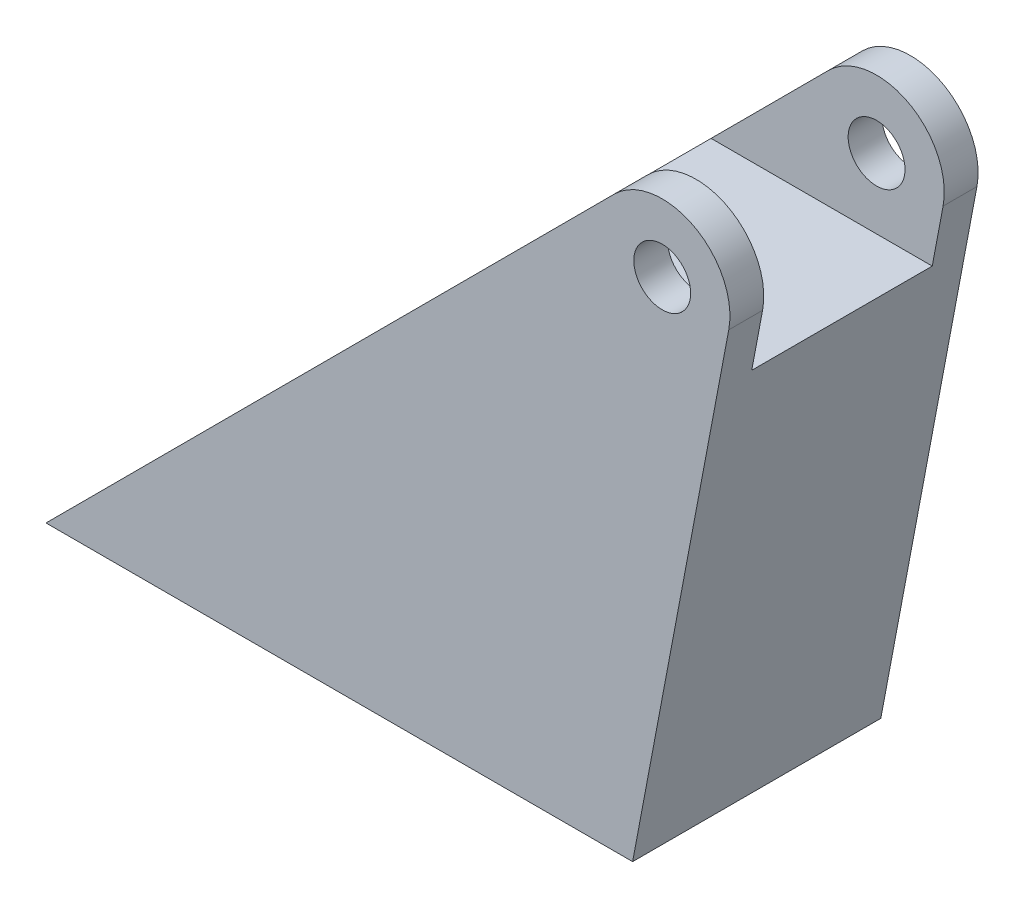
ISO-10303-21;
HEADER;
FILE_DESCRIPTION(('STEP AP214'),'2;1');
FILE_NAME('part.step','',(''),(''),'','','');
FILE_SCHEMA(('AUTOMOTIVE_DESIGN { 1 0 10303 214 1 1 1 1 }'));
ENDSEC;
DATA;
#1=APPLICATION_CONTEXT('core data for automotive mechanical design processes');
#2=APPLICATION_PROTOCOL_DEFINITION('international standard','automotive_design',2000,#1);
#3=PRODUCT_CONTEXT('',#1,'mechanical');
#4=PRODUCT('Part','Part','',(#3));
#5=PRODUCT_RELATED_PRODUCT_CATEGORY('part','',(#4));
#6=PRODUCT_DEFINITION_FORMATION('','',#4);
#7=PRODUCT_DEFINITION_CONTEXT('part definition',#1,'design');
#8=PRODUCT_DEFINITION('design','',#6,#7);
#9=PRODUCT_DEFINITION_SHAPE('','',#8);
#10=(LENGTH_UNIT() NAMED_UNIT(*) SI_UNIT(.MILLI.,.METRE.));
#11=(NAMED_UNIT(*) PLANE_ANGLE_UNIT() SI_UNIT($,.RADIAN.));
#12=(NAMED_UNIT(*) SI_UNIT($,.STERADIAN.) SOLID_ANGLE_UNIT());
#13=UNCERTAINTY_MEASURE_WITH_UNIT(LENGTH_MEASURE(1.E-05),#10,'distance_accuracy_value','');
#14=(GEOMETRIC_REPRESENTATION_CONTEXT(3) GLOBAL_UNCERTAINTY_ASSIGNED_CONTEXT((#13)) GLOBAL_UNIT_ASSIGNED_CONTEXT((#10,
#11,#12)) REPRESENTATION_CONTEXT('',''));
#15=CARTESIAN_POINT('',(0.,0.,0.));
#16=DIRECTION('',(0.,0.,1.));
#17=DIRECTION('',(1.,0.,0.));
#18=AXIS2_PLACEMENT_3D('',#15,#16,#17);
#19=CARTESIAN_POINT('',(4.16611869461281,92.3902344014633,0.));
#20=DIRECTION('',(0.,0.,1.));
#21=DIRECTION('',(1.,0.,0.));
#22=AXIS2_PLACEMENT_3D('',#19,#20,#21);
#23=PLANE('',#22);
#24=CARTESIAN_POINT('',(4.16611869461281,92.3902344014633,0.));
#25=DIRECTION('',(0.,0.,1.));
#26=DIRECTION('',(1.,0.,0.));
#27=AXIS2_PLACEMENT_3D('',#24,#25,#26);
#28=CIRCLE('',#27,4.00000000000001);
#29=CARTESIAN_POINT('',(8.16611869461282,92.3902344014633,0.));
#30=VERTEX_POINT('',#29);
#31=EDGE_CURVE('E96',#30,#30,#28,.T.);
#32=ORIENTED_EDGE('',*,*,#31,.T.);
#33=EDGE_LOOP('',(#32));
#34=FACE_BOUND('',#33,.T.);
#35=DIRECTION('',(1.,0.,0.));
#36=VECTOR('',#35,1.);
#37=CARTESIAN_POINT('',(-82.55,19.05,0.));
#38=LINE('',#37,#36);
#39=CARTESIAN_POINT('',(-82.55,19.05,0.));
#40=VERTEX_POINT('',#39);
#41=CARTESIAN_POINT('',(0.,19.05,0.));
#42=VERTEX_POINT('',#41);
#43=EDGE_CURVE('E108',#40,#42,#38,.T.);
#44=ORIENTED_EDGE('',*,*,#43,.F.);
#45=DIRECTION('',(-0.70668916022688,-0.707524155642637,0.));
#46=VECTOR('',#45,1.);
#47=CARTESIAN_POINT('',(-82.55,19.05,0.));
#48=LINE('',#47,#46);
#49=CARTESIAN_POINT('',(-2.57304888788332,99.1214486526243,0.));
#50=VERTEX_POINT('',#49);
#51=EDGE_CURVE('E84',#50,#40,#48,.T.);
#52=ORIENTED_EDGE('',*,*,#51,.F.);
#53=CARTESIAN_POINT('',(4.16611869461281,92.3902344014633,0.));
#54=DIRECTION('',(0.,0.,1.));
#55=DIRECTION('',(1.,0.,0.));
#56=AXIS2_PLACEMENT_3D('',#53,#54,#55);
#57=CIRCLE('',#56,9.52500000000001);
#58=CARTESIAN_POINT('',(13.5254606994384,90.6215223738264,0.));
#59=VERTEX_POINT('',#58);
#60=EDGE_CURVE('E89',#59,#50,#57,.T.);
#61=ORIENTED_EDGE('',*,*,#60,.F.);
#62=DIRECTION('',(0.185691551457944,0.982608084496124,0.));
#63=VECTOR('',#62,1.);
#64=CARTESIAN_POINT('',(0.,19.05,0.));
#65=LINE('',#64,#63);
#66=EDGE_CURVE('E71',#42,#59,#65,.T.);
#67=ORIENTED_EDGE('',*,*,#66,.F.);
#68=EDGE_LOOP('',(#44,#52,#61,#67));
#69=FACE_BOUND('',#68,.T.);
#70=ADVANCED_FACE('F37',(#34,#69),#23,.F.);
#71=CARTESIAN_POINT('',(4.16611869461281,92.3902344014633,34.925));
#72=DIRECTION('',(0.,0.,1.));
#73=DIRECTION('',(1.,0.,0.));
#74=AXIS2_PLACEMENT_3D('',#71,#72,#73);
#75=PLANE('',#74);
#76=CARTESIAN_POINT('',(4.16611869461281,92.3902344014633,34.925));
#77=DIRECTION('',(0.,0.,1.));
#78=DIRECTION('',(1.,0.,0.));
#79=AXIS2_PLACEMENT_3D('',#76,#77,#78);
#80=CIRCLE('',#79,4.00000000000001);
#81=CARTESIAN_POINT('',(8.16611869461282,92.3902344014633,34.925));
#82=VERTEX_POINT('',#81);
#83=EDGE_CURVE('E156',#82,#82,#80,.T.);
#84=ORIENTED_EDGE('',*,*,#83,.F.);
#85=EDGE_LOOP('',(#84));
#86=FACE_BOUND('',#85,.T.);
#87=DIRECTION('',(0.70668916022688,0.707524155642637,0.));
#88=VECTOR('',#87,1.);
#89=CARTESIAN_POINT('',(-50.8487334230164,50.7887235152745,34.925));
#90=LINE('',#89,#88);
#91=CARTESIAN_POINT('',(-82.55,19.05,34.925));
#92=VERTEX_POINT('',#91);
#93=CARTESIAN_POINT('',(-2.5730488878833,99.1214486526243,34.925));
#94=VERTEX_POINT('',#93);
#95=EDGE_CURVE('E149',#92,#94,#90,.T.);
#96=ORIENTED_EDGE('',*,*,#95,.F.);
#97=DIRECTION('',(-1.,0.,0.));
#98=VECTOR('',#97,1.);
#99=CARTESIAN_POINT('',(0.,19.05,34.925));
#100=LINE('',#99,#98);
#101=CARTESIAN_POINT('',(0.,19.05,34.925));
#102=VERTEX_POINT('',#101);
#103=EDGE_CURVE('E111',#102,#92,#100,.T.);
#104=ORIENTED_EDGE('',*,*,#103,.F.);
#105=DIRECTION('',(-0.185691551457944,-0.982608084496124,0.));
#106=VECTOR('',#105,1.);
#107=CARTESIAN_POINT('',(-3.47590147500313,0.656869760988449,34.925));
#108=LINE('',#107,#106);
#109=CARTESIAN_POINT('',(13.5254606994384,90.6215223738264,34.925));
#110=VERTEX_POINT('',#109);
#111=EDGE_CURVE('E143',#110,#102,#108,.T.);
#112=ORIENTED_EDGE('',*,*,#111,.F.);
#113=CARTESIAN_POINT('',(4.16611869461281,92.3902344014633,34.925));
#114=DIRECTION('',(0.,0.,1.));
#115=DIRECTION('',(1.,0.,0.));
#116=AXIS2_PLACEMENT_3D('',#113,#114,#115);
#117=CIRCLE('',#116,9.52500000000001);
#118=EDGE_CURVE('E158',#110,#94,#117,.T.);
#119=ORIENTED_EDGE('',*,*,#118,.T.);
#120=EDGE_LOOP('',(#96,#104,#112,#119));
#121=FACE_BOUND('',#120,.T.);
#122=ADVANCED_FACE('F226',(#86,#121),#75,.T.);
#123=CARTESIAN_POINT('',(4.16611869461281,92.3902344014633,4.7625));
#124=DIRECTION('',(0.,0.,1.));
#125=DIRECTION('',(1.,0.,0.));
#126=AXIS2_PLACEMENT_3D('',#123,#124,#125);
#127=PLANE('',#126);
#128=DIRECTION('',(-1.,0.,0.));
#129=VECTOR('',#128,1.);
#130=CARTESIAN_POINT('',(-19.1249404928125,82.55,4.7625));
#131=LINE('',#130,#129);
#132=CARTESIAN_POINT('',(12.0001185657108,82.55,4.7625));
#133=VERTEX_POINT('',#132);
#134=CARTESIAN_POINT('',(-19.1249404928125,82.55,4.7625));
#135=VERTEX_POINT('',#134);
#136=EDGE_CURVE('E52',#133,#135,#131,.T.);
#137=ORIENTED_EDGE('',*,*,#136,.F.);
#138=DIRECTION('',(0.185691551457944,0.982608084496124,0.));
#139=VECTOR('',#138,1.);
#140=CARTESIAN_POINT('',(0.,19.05,4.7625));
#141=LINE('',#140,#139);
#142=CARTESIAN_POINT('',(13.5254606994384,90.6215223738264,4.7625));
#143=VERTEX_POINT('',#142);
#144=EDGE_CURVE('E57',#133,#143,#141,.T.);
#145=ORIENTED_EDGE('',*,*,#144,.T.);
#146=CARTESIAN_POINT('',(4.16611869461281,92.3902344014633,4.7625));
#147=DIRECTION('',(0.,0.,1.));
#148=DIRECTION('',(1.,0.,0.));
#149=AXIS2_PLACEMENT_3D('',#146,#147,#148);
#150=CIRCLE('',#149,9.52500000000001);
#151=CARTESIAN_POINT('',(-2.57304888788332,99.1214486526243,4.7625));
#152=VERTEX_POINT('',#151);
#153=EDGE_CURVE('E83',#143,#152,#150,.T.);
#154=ORIENTED_EDGE('',*,*,#153,.T.);
#155=DIRECTION('',(-0.70668916022688,-0.707524155642637,0.));
#156=VECTOR('',#155,1.);
#157=CARTESIAN_POINT('',(-82.55,19.05,4.7625));
#158=LINE('',#157,#156);
#159=EDGE_CURVE('E120',#152,#135,#158,.T.);
#160=ORIENTED_EDGE('',*,*,#159,.T.);
#161=EDGE_LOOP('',(#137,#145,#154,#160));
#162=FACE_BOUND('',#161,.T.);
#163=CARTESIAN_POINT('',(4.16611869461281,92.3902344014633,4.7625));
#164=DIRECTION('',(0.,0.,1.));
#165=DIRECTION('',(1.,0.,0.));
#166=AXIS2_PLACEMENT_3D('',#163,#164,#165);
#167=CIRCLE('',#166,4.00000000000001);
#168=CARTESIAN_POINT('',(8.16611869461282,92.3902344014633,4.7625));
#169=VERTEX_POINT('',#168);
#170=EDGE_CURVE('E92',#169,#169,#167,.T.);
#171=ORIENTED_EDGE('',*,*,#170,.F.);
#172=EDGE_LOOP('',(#171));
#173=FACE_BOUND('',#172,.T.);
#174=ADVANCED_FACE('F125',(#162,#173),#127,.T.);
#175=CARTESIAN_POINT('',(4.16611869461281,92.3902344014633,4.7625));
#176=DIRECTION('',(0.,0.,-1.));
#177=DIRECTION('',(-1.,0.,0.));
#178=AXIS2_PLACEMENT_3D('',#175,#176,#177);
#179=CYLINDRICAL_SURFACE('',#178,9.52500000000001);
#180=ORIENTED_EDGE('',*,*,#60,.T.);
#181=DIRECTION('',(0.,0.,-1.));
#182=VECTOR('',#181,1.);
#183=CARTESIAN_POINT('',(-2.57304888788332,99.1214486526243,4.7625));
#184=LINE('',#183,#182);
#185=EDGE_CURVE('E11',#152,#50,#184,.T.);
#186=ORIENTED_EDGE('',*,*,#185,.F.);
#187=ORIENTED_EDGE('',*,*,#153,.F.);
#188=DIRECTION('',(0.,0.,-1.));
#189=VECTOR('',#188,1.);
#190=CARTESIAN_POINT('',(13.5254606994384,90.6215223738264,4.7625));
#191=LINE('',#190,#189);
#192=EDGE_CURVE('E74',#143,#59,#191,.T.);
#193=ORIENTED_EDGE('',*,*,#192,.T.);
#194=EDGE_LOOP('',(#180,#186,#187,#193));
#195=FACE_BOUND('',#194,.T.);
#196=ADVANCED_FACE('F39',(#195),#179,.T.);
#197=CARTESIAN_POINT('',(-82.55,19.05,4.7625));
#198=DIRECTION('',(0.707524155642637,-0.70668916022688,0.));
#199=DIRECTION('',(0.70668916022688,0.707524155642637,0.));
#200=AXIS2_PLACEMENT_3D('',#197,#198,#199);
#201=PLANE('',#200);
#202=CARTESIAN_POINT('',(-73.025,28.5862543559215,9.525));
#203=DIRECTION('',(0.707524155642637,-0.70668916022688,0.));
#204=DIRECTION('',(-0.70668916022688,-0.707524155642637,0.));
#205=AXIS2_PLACEMENT_3D('',#202,#203,#204);
#206=ELLIPSE('',#205,4.61857940335767,3.26389999999999);
#207=CARTESIAN_POINT('',(-76.2889,25.3184978632924,9.525));
#208=VERTEX_POINT('',#207);
#209=EDGE_CURVE('E116',#208,#208,#206,.T.);
#210=ORIENTED_EDGE('',*,*,#209,.T.);
#211=EDGE_LOOP('',(#210));
#212=FACE_BOUND('',#211,.T.);
#213=CARTESIAN_POINT('',(-73.025,28.5862543559215,28.575));
#214=DIRECTION('',(0.707524155642637,-0.70668916022688,0.));
#215=DIRECTION('',(-0.70668916022688,-0.707524155642637,0.));
#216=AXIS2_PLACEMENT_3D('',#213,#214,#215);
#217=ELLIPSE('',#216,4.61857940335767,3.26389999999999);
#218=CARTESIAN_POINT('',(-76.2889,25.3184978632924,28.575));
#219=VERTEX_POINT('',#218);
#220=EDGE_CURVE('E170',#219,#219,#217,.T.);
#221=ORIENTED_EDGE('',*,*,#220,.T.);
#222=EDGE_LOOP('',(#221));
#223=FACE_BOUND('',#222,.T.);
#224=CARTESIAN_POINT('',(-73.025,28.5862543559215,19.05));
#225=DIRECTION('',(0.707524155642637,-0.70668916022688,0.));
#226=DIRECTION('',(-0.70668916022688,-0.707524155642637,0.));
#227=AXIS2_PLACEMENT_3D('',#224,#225,#226);
#228=ELLIPSE('',#227,4.61857940335767,3.2639);
#229=CARTESIAN_POINT('',(-76.2889,25.3184978632924,19.05));
#230=VERTEX_POINT('',#229);
#231=EDGE_CURVE('E173',#230,#230,#228,.T.);
#232=ORIENTED_EDGE('',*,*,#231,.T.);
#233=EDGE_LOOP('',(#232));
#234=FACE_BOUND('',#233,.T.);
#235=ORIENTED_EDGE('',*,*,#51,.T.);
#236=DIRECTION('',(0.,0.,-1.));
#237=VECTOR('',#236,1.);
#238=CARTESIAN_POINT('',(-82.55,19.05,4.7625));
#239=LINE('',#238,#237);
#240=EDGE_CURVE('E45',#92,#40,#239,.T.);
#241=ORIENTED_EDGE('',*,*,#240,.F.);
#242=ORIENTED_EDGE('',*,*,#95,.T.);
#243=DIRECTION('',(0.,0.,-1.));
#244=VECTOR('',#243,1.);
#245=CARTESIAN_POINT('',(-2.5730488878833,99.1214486526243,34.925));
#246=LINE('',#245,#244);
#247=CARTESIAN_POINT('',(-2.5730488878833,99.1214486526243,30.1625));
#248=VERTEX_POINT('',#247);
#249=EDGE_CURVE('E140',#94,#248,#246,.T.);
#250=ORIENTED_EDGE('',*,*,#249,.T.);
#251=DIRECTION('',(0.70668916022688,0.707524155642637,0.));
#252=VECTOR('',#251,1.);
#253=CARTESIAN_POINT('',(-50.8487334230164,50.7887235152745,30.1625));
#254=LINE('',#253,#252);
#255=CARTESIAN_POINT('',(-19.1249404928125,82.55,30.1625));
#256=VERTEX_POINT('',#255);
#257=EDGE_CURVE('E153',#256,#248,#254,.T.);
#258=ORIENTED_EDGE('',*,*,#257,.F.);
#259=DIRECTION('',(0.,0.,-1.));
#260=VECTOR('',#259,1.);
#261=CARTESIAN_POINT('',(-19.1249404928125,82.55,30.1625));
#262=LINE('',#261,#260);
#263=EDGE_CURVE('E124',#256,#135,#262,.T.);
#264=ORIENTED_EDGE('',*,*,#263,.T.);
#265=ORIENTED_EDGE('',*,*,#159,.F.);
#266=ORIENTED_EDGE('',*,*,#185,.T.);
#267=EDGE_LOOP('',(#235,#241,#242,#250,#258,#264,#265,#266));
#268=FACE_BOUND('',#267,.T.);
#269=ADVANCED_FACE('F118',(#212,#223,#234,#268),#201,.F.);
#270=CARTESIAN_POINT('',(0.,19.05,4.7625));
#271=DIRECTION('',(-0.982608084496124,0.185691551457944,0.));
#272=DIRECTION('',(-0.185691551457944,-0.982608084496124,0.));
#273=AXIS2_PLACEMENT_3D('',#270,#271,#272);
#274=PLANE('',#273);
#275=ORIENTED_EDGE('',*,*,#66,.T.);
#276=ORIENTED_EDGE('',*,*,#192,.F.);
#277=ORIENTED_EDGE('',*,*,#144,.F.);
#278=DIRECTION('',(0.,0.,-1.));
#279=VECTOR('',#278,1.);
#280=CARTESIAN_POINT('',(12.0001185657108,82.55,30.1625));
#281=LINE('',#280,#279);
#282=CARTESIAN_POINT('',(12.0001185657108,82.55,30.1625));
#283=VERTEX_POINT('',#282);
#284=EDGE_CURVE('E130',#283,#133,#281,.T.);
#285=ORIENTED_EDGE('',*,*,#284,.F.);
#286=DIRECTION('',(-0.185691551457944,-0.982608084496124,0.));
#287=VECTOR('',#286,1.);
#288=CARTESIAN_POINT('',(-3.47590147500313,0.656869760988449,30.1625));
#289=LINE('',#288,#287);
#290=CARTESIAN_POINT('',(13.5254606994384,90.6215223738264,30.1625));
#291=VERTEX_POINT('',#290);
#292=EDGE_CURVE('E146',#291,#283,#289,.T.);
#293=ORIENTED_EDGE('',*,*,#292,.F.);
#294=DIRECTION('',(0.,0.,-1.));
#295=VECTOR('',#294,1.);
#296=CARTESIAN_POINT('',(13.5254606994384,90.6215223738264,34.925));
#297=LINE('',#296,#295);
#298=EDGE_CURVE('E137',#110,#291,#297,.T.);
#299=ORIENTED_EDGE('',*,*,#298,.F.);
#300=ORIENTED_EDGE('',*,*,#111,.T.);
#301=DIRECTION('',(0.,0.,-1.));
#302=VECTOR('',#301,1.);
#303=CARTESIAN_POINT('',(0.,19.05,4.7625));
#304=LINE('',#303,#302);
#305=EDGE_CURVE('E79',#102,#42,#304,.T.);
#306=ORIENTED_EDGE('',*,*,#305,.T.);
#307=EDGE_LOOP('',(#275,#276,#277,#285,#293,#299,#300,#306));
#308=FACE_BOUND('',#307,.T.);
#309=ADVANCED_FACE('F73',(#308),#274,.F.);
#310=CARTESIAN_POINT('',(4.16611869461281,92.3902344014633,4.7625));
#311=DIRECTION('',(0.,0.,-1.));
#312=DIRECTION('',(-1.,0.,0.));
#313=AXIS2_PLACEMENT_3D('',#310,#311,#312);
#314=CYLINDRICAL_SURFACE('',#313,4.00000000000001);
#315=ORIENTED_EDGE('',*,*,#170,.T.);
#316=EDGE_LOOP('',(#315));
#317=FACE_BOUND('',#316,.T.);
#318=ORIENTED_EDGE('',*,*,#31,.F.);
#319=EDGE_LOOP('',(#318));
#320=FACE_BOUND('',#319,.T.);
#321=ADVANCED_FACE('F238',(#317,#320),#314,.F.);
#322=CARTESIAN_POINT('',(-19.1249404928125,82.55,30.1625));
#323=DIRECTION('',(0.,-1.,0.));
#324=DIRECTION('',(0.,0.,-1.));
#325=AXIS2_PLACEMENT_3D('',#322,#323,#324);
#326=PLANE('',#325);
#327=ORIENTED_EDGE('',*,*,#136,.T.);
#328=ORIENTED_EDGE('',*,*,#263,.F.);
#329=DIRECTION('',(-1.,0.,0.));
#330=VECTOR('',#329,1.);
#331=CARTESIAN_POINT('',(-19.1249404928125,82.55,30.1625));
#332=LINE('',#331,#330);
#333=EDGE_CURVE('E135',#283,#256,#332,.T.);
#334=ORIENTED_EDGE('',*,*,#333,.F.);
#335=ORIENTED_EDGE('',*,*,#284,.T.);
#336=EDGE_LOOP('',(#327,#328,#334,#335));
#337=FACE_BOUND('',#336,.T.);
#338=ADVANCED_FACE('F369',(#337),#326,.F.);
#339=CARTESIAN_POINT('',(4.16611869461281,92.3902344014633,30.1625));
#340=DIRECTION('',(0.,0.,1.));
#341=DIRECTION('',(1.,0.,0.));
#342=AXIS2_PLACEMENT_3D('',#339,#340,#341);
#343=PLANE('',#342);
#344=CARTESIAN_POINT('',(4.16611869461281,92.3902344014633,30.1625));
#345=DIRECTION('',(0.,0.,1.));
#346=DIRECTION('',(1.,0.,0.));
#347=AXIS2_PLACEMENT_3D('',#344,#345,#346);
#348=CIRCLE('',#347,4.00000000000001);
#349=CARTESIAN_POINT('',(8.16611869461282,92.3902344014633,30.1625));
#350=VERTEX_POINT('',#349);
#351=EDGE_CURVE('E162',#350,#350,#348,.T.);
#352=ORIENTED_EDGE('',*,*,#351,.T.);
#353=EDGE_LOOP('',(#352));
#354=FACE_BOUND('',#353,.T.);
#355=ORIENTED_EDGE('',*,*,#292,.T.);
#356=ORIENTED_EDGE('',*,*,#333,.T.);
#357=ORIENTED_EDGE('',*,*,#257,.T.);
#358=CARTESIAN_POINT('',(4.16611869461281,92.3902344014633,30.1625));
#359=DIRECTION('',(0.,0.,1.));
#360=DIRECTION('',(1.,0.,0.));
#361=AXIS2_PLACEMENT_3D('',#358,#359,#360);
#362=CIRCLE('',#361,9.52500000000001);
#363=EDGE_CURVE('E150',#291,#248,#362,.T.);
#364=ORIENTED_EDGE('',*,*,#363,.F.);
#365=EDGE_LOOP('',(#355,#356,#357,#364));
#366=FACE_BOUND('',#365,.T.);
#367=ADVANCED_FACE('F360',(#354,#366),#343,.F.);
#368=CARTESIAN_POINT('',(4.16611869461281,92.3902344014633,34.925));
#369=DIRECTION('',(0.,0.,-1.));
#370=DIRECTION('',(-1.,0.,0.));
#371=AXIS2_PLACEMENT_3D('',#368,#369,#370);
#372=CYLINDRICAL_SURFACE('',#371,9.52500000000001);
#373=ORIENTED_EDGE('',*,*,#363,.T.);
#374=ORIENTED_EDGE('',*,*,#249,.F.);
#375=ORIENTED_EDGE('',*,*,#118,.F.);
#376=ORIENTED_EDGE('',*,*,#298,.T.);
#377=EDGE_LOOP('',(#373,#374,#375,#376));
#378=FACE_BOUND('',#377,.T.);
#379=ADVANCED_FACE('F351',(#378),#372,.T.);
#380=CARTESIAN_POINT('',(4.16611869461281,92.3902344014633,34.925));
#381=DIRECTION('',(0.,0.,-1.));
#382=DIRECTION('',(-1.,0.,0.));
#383=AXIS2_PLACEMENT_3D('',#380,#381,#382);
#384=CYLINDRICAL_SURFACE('',#383,4.00000000000001);
#385=ORIENTED_EDGE('',*,*,#83,.T.);
#386=EDGE_LOOP('',(#385));
#387=FACE_BOUND('',#386,.T.);
#388=ORIENTED_EDGE('',*,*,#351,.F.);
#389=EDGE_LOOP('',(#388));
#390=FACE_BOUND('',#389,.T.);
#391=ADVANCED_FACE('F210',(#387,#390),#384,.F.);
#392=CARTESIAN_POINT('',(0.,19.05,0.));
#393=DIRECTION('',(0.,-1.,0.));
#394=DIRECTION('',(0.,0.,-1.));
#395=AXIS2_PLACEMENT_3D('',#392,#393,#394);
#396=PLANE('',#395);
#397=CARTESIAN_POINT('',(-73.025,19.05,9.525));
#398=DIRECTION('',(0.,-1.,0.));
#399=DIRECTION('',(0.,0.,-1.));
#400=AXIS2_PLACEMENT_3D('',#397,#398,#399);
#401=CIRCLE('',#400,3.26389999999999);
#402=CARTESIAN_POINT('',(-73.025,19.05,6.2611));
#403=VERTEX_POINT('',#402);
#404=EDGE_CURVE('E180',#403,#403,#401,.T.);
#405=ORIENTED_EDGE('',*,*,#404,.F.);
#406=EDGE_LOOP('',(#405));
#407=FACE_BOUND('',#406,.T.);
#408=CARTESIAN_POINT('',(-73.025,19.05,28.575));
#409=DIRECTION('',(0.,-1.,0.));
#410=DIRECTION('',(0.,0.,1.));
#411=AXIS2_PLACEMENT_3D('',#408,#409,#410);
#412=CIRCLE('',#411,3.26389999999999);
#413=CARTESIAN_POINT('',(-73.025,19.05,31.8389));
#414=VERTEX_POINT('',#413);
#415=EDGE_CURVE('E196',#414,#414,#412,.T.);
#416=ORIENTED_EDGE('',*,*,#415,.F.);
#417=EDGE_LOOP('',(#416));
#418=FACE_BOUND('',#417,.T.);
#419=CARTESIAN_POINT('',(-9.525,19.05,28.575));
#420=DIRECTION('',(0.,-1.,0.));
#421=DIRECTION('',(0.,0.,1.));
#422=AXIS2_PLACEMENT_3D('',#419,#420,#421);
#423=CIRCLE('',#422,3.2639);
#424=CARTESIAN_POINT('',(-9.525,19.05,31.8389));
#425=VERTEX_POINT('',#424);
#426=EDGE_CURVE('E190',#425,#425,#423,.T.);
#427=ORIENTED_EDGE('',*,*,#426,.F.);
#428=EDGE_LOOP('',(#427));
#429=FACE_BOUND('',#428,.T.);
#430=CARTESIAN_POINT('',(-9.525,19.05,19.05));
#431=DIRECTION('',(0.,-1.,0.));
#432=DIRECTION('',(0.,0.,-1.));
#433=AXIS2_PLACEMENT_3D('',#430,#431,#432);
#434=CIRCLE('',#433,3.2639);
#435=CARTESIAN_POINT('',(-9.525,19.05,15.7861));
#436=VERTEX_POINT('',#435);
#437=EDGE_CURVE('E183',#436,#436,#434,.T.);
#438=ORIENTED_EDGE('',*,*,#437,.F.);
#439=EDGE_LOOP('',(#438));
#440=FACE_BOUND('',#439,.T.);
#441=CARTESIAN_POINT('',(-73.025,19.05,19.05));
#442=DIRECTION('',(0.,-1.,0.));
#443=DIRECTION('',(0.,0.,-1.));
#444=AXIS2_PLACEMENT_3D('',#441,#442,#443);
#445=CIRCLE('',#444,3.2639);
#446=CARTESIAN_POINT('',(-73.025,19.05,15.7861));
#447=VERTEX_POINT('',#446);
#448=EDGE_CURVE('E187',#447,#447,#445,.T.);
#449=ORIENTED_EDGE('',*,*,#448,.F.);
#450=EDGE_LOOP('',(#449));
#451=FACE_BOUND('',#450,.T.);
#452=CARTESIAN_POINT('',(-9.525,19.05,9.52500000000001));
#453=DIRECTION('',(0.,-1.,0.));
#454=DIRECTION('',(0.,0.,-1.));
#455=AXIS2_PLACEMENT_3D('',#452,#453,#454);
#456=CIRCLE('',#455,3.2639);
#457=CARTESIAN_POINT('',(-9.525,19.05,6.26110000000001));
#458=VERTEX_POINT('',#457);
#459=EDGE_CURVE('E177',#458,#458,#456,.T.);
#460=ORIENTED_EDGE('',*,*,#459,.F.);
#461=EDGE_LOOP('',(#460));
#462=FACE_BOUND('',#461,.T.);
#463=ORIENTED_EDGE('',*,*,#240,.T.);
#464=ORIENTED_EDGE('',*,*,#43,.T.);
#465=ORIENTED_EDGE('',*,*,#305,.F.);
#466=ORIENTED_EDGE('',*,*,#103,.T.);
#467=EDGE_LOOP('',(#463,#464,#465,#466));
#468=FACE_BOUND('',#467,.T.);
#469=ADVANCED_FACE('F107',(#407,#418,#429,#440,#451,#462,#468),#396,.T.);
#470=CARTESIAN_POINT('',(-9.525,50.8,9.52500000000001));
#471=DIRECTION('',(0.,-1.,0.));
#472=DIRECTION('',(0.,0.,-1.));
#473=AXIS2_PLACEMENT_3D('',#470,#471,#472);
#474=CYLINDRICAL_SURFACE('',#473,3.2639);
#475=CARTESIAN_POINT('',(-9.525,50.8,9.52500000000001));
#476=DIRECTION('',(0.,-1.,0.));
#477=DIRECTION('',(0.,0.,-1.));
#478=AXIS2_PLACEMENT_3D('',#475,#476,#477);
#479=CIRCLE('',#478,3.2639);
#480=CARTESIAN_POINT('',(-9.525,50.8,6.26110000000001));
#481=VERTEX_POINT('',#480);
#482=EDGE_CURVE('E176',#481,#481,#479,.T.);
#483=ORIENTED_EDGE('',*,*,#482,.F.);
#484=EDGE_LOOP('',(#483));
#485=FACE_BOUND('',#484,.T.);
#486=ORIENTED_EDGE('',*,*,#459,.T.);
#487=EDGE_LOOP('',(#486));
#488=FACE_BOUND('',#487,.T.);
#489=ADVANCED_FACE('F209',(#485,#488),#474,.F.);
#490=CARTESIAN_POINT('',(-9.525,50.8,9.52500000000001));
#491=DIRECTION('',(0.,-1.,0.));
#492=DIRECTION('',(0.,0.,-1.));
#493=AXIS2_PLACEMENT_3D('',#490,#491,#492);
#494=PLANE('',#493);
#495=ORIENTED_EDGE('',*,*,#482,.T.);
#496=EDGE_LOOP('',(#495));
#497=FACE_BOUND('',#496,.T.);
#498=ADVANCED_FACE('F216',(#497),#494,.T.);
#499=CARTESIAN_POINT('',(-73.025,50.8,19.05));
#500=DIRECTION('',(0.,-1.,0.));
#501=DIRECTION('',(0.,0.,-1.));
#502=AXIS2_PLACEMENT_3D('',#499,#500,#501);
#503=CYLINDRICAL_SURFACE('',#502,3.2639);
#504=ORIENTED_EDGE('',*,*,#448,.T.);
#505=EDGE_LOOP('',(#504));
#506=FACE_BOUND('',#505,.T.);
#507=ORIENTED_EDGE('',*,*,#231,.F.);
#508=EDGE_LOOP('',(#507));
#509=FACE_BOUND('',#508,.T.);
#510=ADVANCED_FACE('F204',(#506,#509),#503,.F.);
#511=CARTESIAN_POINT('',(-9.525,50.8,19.05));
#512=DIRECTION('',(0.,-1.,0.));
#513=DIRECTION('',(0.,0.,-1.));
#514=AXIS2_PLACEMENT_3D('',#511,#512,#513);
#515=CYLINDRICAL_SURFACE('',#514,3.2639);
#516=CARTESIAN_POINT('',(-9.525,50.8,19.05));
#517=DIRECTION('',(0.,-1.,0.));
#518=DIRECTION('',(0.,0.,-1.));
#519=AXIS2_PLACEMENT_3D('',#516,#517,#518);
#520=CIRCLE('',#519,3.2639);
#521=CARTESIAN_POINT('',(-9.525,50.8,15.7861));
#522=VERTEX_POINT('',#521);
#523=EDGE_CURVE('E186',#522,#522,#520,.T.);
#524=ORIENTED_EDGE('',*,*,#523,.F.);
#525=EDGE_LOOP('',(#524));
#526=FACE_BOUND('',#525,.T.);
#527=ORIENTED_EDGE('',*,*,#437,.T.);
#528=EDGE_LOOP('',(#527));
#529=FACE_BOUND('',#528,.T.);
#530=ADVANCED_FACE('F250',(#526,#529),#515,.F.);
#531=CARTESIAN_POINT('',(-9.525,50.8,19.05));
#532=DIRECTION('',(0.,-1.,0.));
#533=DIRECTION('',(0.,0.,-1.));
#534=AXIS2_PLACEMENT_3D('',#531,#532,#533);
#535=PLANE('',#534);
#536=ORIENTED_EDGE('',*,*,#523,.T.);
#537=EDGE_LOOP('',(#536));
#538=FACE_BOUND('',#537,.T.);
#539=ADVANCED_FACE('F255',(#538),#535,.T.);
#540=CARTESIAN_POINT('',(-9.525,50.8,28.575));
#541=DIRECTION('',(0.,-1.,0.));
#542=DIRECTION('',(0.,0.,-1.));
#543=AXIS2_PLACEMENT_3D('',#540,#541,#542);
#544=CYLINDRICAL_SURFACE('',#543,3.2639);
#545=CARTESIAN_POINT('',(-9.525,50.8,28.575));
#546=DIRECTION('',(0.,-1.,0.));
#547=DIRECTION('',(0.,0.,1.));
#548=AXIS2_PLACEMENT_3D('',#545,#546,#547);
#549=CIRCLE('',#548,3.2639);
#550=CARTESIAN_POINT('',(-9.525,50.8,31.8389));
#551=VERTEX_POINT('',#550);
#552=EDGE_CURVE('E193',#551,#551,#549,.T.);
#553=ORIENTED_EDGE('',*,*,#552,.F.);
#554=EDGE_LOOP('',(#553));
#555=FACE_BOUND('',#554,.T.);
#556=ORIENTED_EDGE('',*,*,#426,.T.);
#557=EDGE_LOOP('',(#556));
#558=FACE_BOUND('',#557,.T.);
#559=ADVANCED_FACE('F270',(#555,#558),#544,.F.);
#560=CARTESIAN_POINT('',(-9.525,50.8,28.575));
#561=DIRECTION('',(0.,1.,0.));
#562=DIRECTION('',(0.,0.,1.));
#563=AXIS2_PLACEMENT_3D('',#560,#561,#562);
#564=PLANE('',#563);
#565=ORIENTED_EDGE('',*,*,#552,.T.);
#566=EDGE_LOOP('',(#565));
#567=FACE_BOUND('',#566,.T.);
#568=ADVANCED_FACE('F266',(#567),#564,.F.);
#569=CARTESIAN_POINT('',(-73.025,50.8,28.575));
#570=DIRECTION('',(0.,-1.,0.));
#571=DIRECTION('',(0.,0.,-1.));
#572=AXIS2_PLACEMENT_3D('',#569,#570,#571);
#573=CYLINDRICAL_SURFACE('',#572,3.26389999999999);
#574=ORIENTED_EDGE('',*,*,#415,.T.);
#575=EDGE_LOOP('',(#574));
#576=FACE_BOUND('',#575,.T.);
#577=ORIENTED_EDGE('',*,*,#220,.F.);
#578=EDGE_LOOP('',(#577));
#579=FACE_BOUND('',#578,.T.);
#580=ADVANCED_FACE('F262',(#576,#579),#573,.F.);
#581=CARTESIAN_POINT('',(-73.025,50.8,9.525));
#582=DIRECTION('',(0.,-1.,0.));
#583=DIRECTION('',(0.,0.,-1.));
#584=AXIS2_PLACEMENT_3D('',#581,#582,#583);
#585=CYLINDRICAL_SURFACE('',#584,3.26389999999999);
#586=ORIENTED_EDGE('',*,*,#404,.T.);
#587=EDGE_LOOP('',(#586));
#588=FACE_BOUND('',#587,.T.);
#589=ORIENTED_EDGE('',*,*,#209,.F.);
#590=EDGE_LOOP('',(#589));
#591=FACE_BOUND('',#590,.T.);
#592=ADVANCED_FACE('F259',(#588,#591),#585,.F.);
#593=CLOSED_SHELL('',(#70,#122,#174,#196,#269,#309,#321,#338,#367,#379,#391,#469,#489,#498,#510,
#530,#539,#559,#568,#580,#592));
#594=MANIFOLD_SOLID_BREP('B2',#593);
#595=ADVANCED_BREP_SHAPE_REPRESENTATION('',(#18,#594),#14);
#596=SHAPE_DEFINITION_REPRESENTATION(#9,#595);
ENDSEC;
END-ISO-10303-21;
